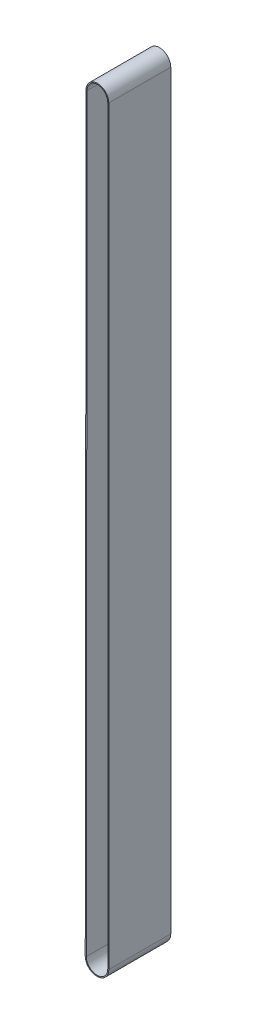
ISO-10303-21;
HEADER;
FILE_DESCRIPTION(('STEP AP214'),'2;1');
FILE_NAME('part.step','',(''),(''),'','','');
FILE_SCHEMA(('AUTOMOTIVE_DESIGN { 1 0 10303 214 1 1 1 1 }'));
ENDSEC;
DATA;
#1=APPLICATION_CONTEXT('core data for automotive mechanical design processes');
#2=APPLICATION_PROTOCOL_DEFINITION('international standard','automotive_design',2000,#1);
#3=PRODUCT_CONTEXT('',#1,'mechanical');
#4=PRODUCT('Part','Part','',(#3));
#5=PRODUCT_RELATED_PRODUCT_CATEGORY('part','',(#4));
#6=PRODUCT_DEFINITION_FORMATION('','',#4);
#7=PRODUCT_DEFINITION_CONTEXT('part definition',#1,'design');
#8=PRODUCT_DEFINITION('design','',#6,#7);
#9=PRODUCT_DEFINITION_SHAPE('','',#8);
#10=(LENGTH_UNIT() NAMED_UNIT(*) SI_UNIT(.MILLI.,.METRE.));
#11=(NAMED_UNIT(*) PLANE_ANGLE_UNIT() SI_UNIT($,.RADIAN.));
#12=(NAMED_UNIT(*) SI_UNIT($,.STERADIAN.) SOLID_ANGLE_UNIT());
#13=UNCERTAINTY_MEASURE_WITH_UNIT(LENGTH_MEASURE(1.E-05),#10,'distance_accuracy_value','');
#14=(GEOMETRIC_REPRESENTATION_CONTEXT(3) GLOBAL_UNCERTAINTY_ASSIGNED_CONTEXT((#13)) GLOBAL_UNIT_ASSIGNED_CONTEXT((#10,
#11,#12)) REPRESENTATION_CONTEXT('',''));
#15=CARTESIAN_POINT('',(0.,0.,0.));
#16=DIRECTION('',(0.,0.,1.));
#17=DIRECTION('',(1.,0.,0.));
#18=AXIS2_PLACEMENT_3D('',#15,#16,#17);
#19=CARTESIAN_POINT('',(-4.46149193977785E-13,-3670.00000000001,300.));
#20=DIRECTION('',(0.,0.,1.));
#21=DIRECTION('',(1.,0.,0.));
#22=AXIS2_PLACEMENT_3D('',#19,#20,#21);
#23=PLANE('',#22);
#24=CARTESIAN_POINT('',(-4.46149193977785E-13,-3670.00000000001,300.));
#25=DIRECTION('',(0.,0.,1.));
#26=DIRECTION('',(1.,0.,0.));
#27=AXIS2_PLACEMENT_3D('',#24,#25,#26);
#28=CIRCLE('',#27,113.999999999998);
#29=CARTESIAN_POINT('',(-113.999930882177,-3669.87446570747,300.));
#30=VERTEX_POINT('',#29);
#31=CARTESIAN_POINT('',(113.999999999998,-3670.00000000001,300.));
#32=VERTEX_POINT('',#31);
#33=EDGE_CURVE('E176',#30,#32,#28,.T.);
#34=ORIENTED_EDGE('',*,*,#33,.T.);
#35=DIRECTION('',(0.,1.,0.));
#36=VECTOR('',#35,1.);
#37=CARTESIAN_POINT('',(113.999999999998,-3670.00000000001,300.));
#38=LINE('',#37,#36);
#39=CARTESIAN_POINT('',(113.999999999998,3595.,300.));
#40=VERTEX_POINT('',#39);
#41=EDGE_CURVE('E180',#32,#40,#38,.T.);
#42=ORIENTED_EDGE('',*,*,#41,.T.);
#43=CARTESIAN_POINT('',(3.99999999999823,3595.,300.));
#44=DIRECTION('',(0.,0.,1.));
#45=DIRECTION('',(1.,0.,0.));
#46=AXIS2_PLACEMENT_3D('',#43,#44,#45);
#47=CIRCLE('',#46,110.);
#48=CARTESIAN_POINT('',(-105.999999855563,3595.00563705871,300.));
#49=VERTEX_POINT('',#48);
#50=EDGE_CURVE('E184',#40,#49,#47,.T.);
#51=ORIENTED_EDGE('',*,*,#50,.T.);
#52=DIRECTION('',(-0.00110117800474589,-0.999999393703317,0.));
#53=VECTOR('',#52,1.);
#54=CARTESIAN_POINT('',(-105.999993937035,3595.01101178005,300.));
#55=LINE('',#54,#53);
#56=EDGE_CURVE('E187',#49,#30,#55,.T.);
#57=ORIENTED_EDGE('',*,*,#56,.T.);
#58=EDGE_LOOP('',(#34,#42,#51,#57));
#59=FACE_BOUND('',#58,.T.);
#60=DIRECTION('',(0.,1.,0.));
#61=VECTOR('',#60,1.);
#62=CARTESIAN_POINT('',(103.999999999998,-3670.00000000001,300.));
#63=LINE('',#62,#61);
#64=CARTESIAN_POINT('',(103.999999999998,-3670.00000000001,300.));
#65=VERTEX_POINT('',#64);
#66=CARTESIAN_POINT('',(103.999999999998,3595.,300.));
#67=VERTEX_POINT('',#66);
#68=EDGE_CURVE('E136',#65,#67,#63,.T.);
#69=ORIENTED_EDGE('',*,*,#68,.F.);
#70=CARTESIAN_POINT('',(-4.46149193977785E-13,-3670.00000000001,300.));
#71=DIRECTION('',(0.,0.,1.));
#72=DIRECTION('',(1.,0.,0.));
#73=AXIS2_PLACEMENT_3D('',#70,#71,#72);
#74=CIRCLE('',#73,103.999999999998);
#75=CARTESIAN_POINT('',(-103.999936945144,-3669.88547748752,300.));
#76=VERTEX_POINT('',#75);
#77=EDGE_CURVE('E127',#76,#65,#74,.T.);
#78=ORIENTED_EDGE('',*,*,#77,.F.);
#79=DIRECTION('',(-0.00110117800474589,-0.999999393703317,0.));
#80=VECTOR('',#79,1.);
#81=CARTESIAN_POINT('',(-96.0000000000016,3595.,300.));
#82=LINE('',#81,#80);
#83=CARTESIAN_POINT('',(-96.0000000000016,3595.,300.));
#84=VERTEX_POINT('',#83);
#85=EDGE_CURVE('E155',#84,#76,#82,.T.);
#86=ORIENTED_EDGE('',*,*,#85,.F.);
#87=CARTESIAN_POINT('',(3.99999999999823,3595.,300.));
#88=DIRECTION('',(0.,0.,1.));
#89=DIRECTION('',(1.,0.,0.));
#90=AXIS2_PLACEMENT_3D('',#87,#88,#89);
#91=CIRCLE('',#90,99.9999999999998);
#92=EDGE_CURVE('E149',#67,#84,#91,.T.);
#93=ORIENTED_EDGE('',*,*,#92,.F.);
#94=EDGE_LOOP('',(#69,#78,#86,#93));
#95=FACE_BOUND('',#94,.T.);
#96=ADVANCED_FACE('F61',(#59,#95),#23,.T.);
#97=CARTESIAN_POINT('',(-4.46149193977785E-13,-3670.00000000001,-300.));
#98=DIRECTION('',(0.,0.,1.));
#99=DIRECTION('',(1.,0.,0.));
#100=AXIS2_PLACEMENT_3D('',#97,#98,#99);
#101=PLANE('',#100);
#102=CARTESIAN_POINT('',(-4.46149193977785E-13,-3670.00000000001,-300.));
#103=DIRECTION('',(0.,0.,1.));
#104=DIRECTION('',(1.,0.,0.));
#105=AXIS2_PLACEMENT_3D('',#102,#103,#104);
#106=CIRCLE('',#105,113.999999999998);
#107=CARTESIAN_POINT('',(-113.999930882177,-3669.87446570747,-300.));
#108=VERTEX_POINT('',#107);
#109=CARTESIAN_POINT('',(113.999999999998,-3670.00000000001,-300.));
#110=VERTEX_POINT('',#109);
#111=EDGE_CURVE('E145',#108,#110,#106,.T.);
#112=ORIENTED_EDGE('',*,*,#111,.F.);
#113=DIRECTION('',(-0.00110117800474589,-0.999999393703317,0.));
#114=VECTOR('',#113,1.);
#115=CARTESIAN_POINT('',(-105.999993937035,3595.01101178005,-300.));
#116=LINE('',#115,#114);
#117=CARTESIAN_POINT('',(-105.999999855563,3595.00563705871,-300.));
#118=VERTEX_POINT('',#117);
#119=EDGE_CURVE('E181',#118,#108,#116,.T.);
#120=ORIENTED_EDGE('',*,*,#119,.F.);
#121=CARTESIAN_POINT('',(3.99999999999823,3595.,-300.));
#122=DIRECTION('',(0.,0.,1.));
#123=DIRECTION('',(1.,0.,0.));
#124=AXIS2_PLACEMENT_3D('',#121,#122,#123);
#125=CIRCLE('',#124,110.);
#126=CARTESIAN_POINT('',(113.999999999998,3595.,-300.));
#127=VERTEX_POINT('',#126);
#128=EDGE_CURVE('E197',#127,#118,#125,.T.);
#129=ORIENTED_EDGE('',*,*,#128,.F.);
#130=DIRECTION('',(0.,1.,0.));
#131=VECTOR('',#130,1.);
#132=CARTESIAN_POINT('',(113.999999999998,-3670.00000000001,-300.));
#133=LINE('',#132,#131);
#134=EDGE_CURVE('E194',#110,#127,#133,.T.);
#135=ORIENTED_EDGE('',*,*,#134,.F.);
#136=EDGE_LOOP('',(#112,#120,#129,#135));
#137=FACE_BOUND('',#136,.T.);
#138=CARTESIAN_POINT('',(-4.46149193977785E-13,-3670.00000000001,-300.));
#139=DIRECTION('',(0.,0.,1.));
#140=DIRECTION('',(1.,0.,0.));
#141=AXIS2_PLACEMENT_3D('',#138,#139,#140);
#142=CIRCLE('',#141,103.999999999998);
#143=CARTESIAN_POINT('',(-103.999936945144,-3669.88547748752,-300.));
#144=VERTEX_POINT('',#143);
#145=CARTESIAN_POINT('',(103.999999999998,-3670.00000000001,-300.));
#146=VERTEX_POINT('',#145);
#147=EDGE_CURVE('E85',#144,#146,#142,.T.);
#148=ORIENTED_EDGE('',*,*,#147,.T.);
#149=DIRECTION('',(0.,1.,0.));
#150=VECTOR('',#149,1.);
#151=CARTESIAN_POINT('',(103.999999999998,-3670.00000000001,-300.));
#152=LINE('',#151,#150);
#153=CARTESIAN_POINT('',(103.999999999998,3595.,-300.));
#154=VERTEX_POINT('',#153);
#155=EDGE_CURVE('E143',#146,#154,#152,.T.);
#156=ORIENTED_EDGE('',*,*,#155,.T.);
#157=CARTESIAN_POINT('',(3.99999999999823,3595.,-300.));
#158=DIRECTION('',(0.,0.,1.));
#159=DIRECTION('',(1.,0.,0.));
#160=AXIS2_PLACEMENT_3D('',#157,#158,#159);
#161=CIRCLE('',#160,99.9999999999998);
#162=CARTESIAN_POINT('',(-96.0000000000016,3595.,-300.));
#163=VERTEX_POINT('',#162);
#164=EDGE_CURVE('E164',#154,#163,#161,.T.);
#165=ORIENTED_EDGE('',*,*,#164,.T.);
#166=DIRECTION('',(-0.00110117800474589,-0.999999393703317,0.));
#167=VECTOR('',#166,1.);
#168=CARTESIAN_POINT('',(-96.0000000000016,3595.,-300.));
#169=LINE('',#168,#167);
#170=EDGE_CURVE('E137',#163,#144,#169,.T.);
#171=ORIENTED_EDGE('',*,*,#170,.T.);
#172=EDGE_LOOP('',(#148,#156,#165,#171));
#173=FACE_BOUND('',#172,.T.);
#174=ADVANCED_FACE('F219',(#137,#173),#101,.F.);
#175=CARTESIAN_POINT('',(-4.46149193977785E-13,-3670.00000000001,300.));
#176=DIRECTION('',(0.,0.,-1.));
#177=DIRECTION('',(-1.,0.,0.));
#178=AXIS2_PLACEMENT_3D('',#175,#176,#177);
#179=CYLINDRICAL_SURFACE('',#178,113.999999999998);
#180=ORIENTED_EDGE('',*,*,#111,.T.);
#181=DIRECTION('',(0.,0.,-1.));
#182=VECTOR('',#181,1.);
#183=CARTESIAN_POINT('',(113.999999999998,-3670.00000000001,300.));
#184=LINE('',#183,#182);
#185=EDGE_CURVE('E12',#32,#110,#184,.T.);
#186=ORIENTED_EDGE('',*,*,#185,.F.);
#187=ORIENTED_EDGE('',*,*,#33,.F.);
#188=DIRECTION('',(0.,0.,-1.));
#189=VECTOR('',#188,1.);
#190=CARTESIAN_POINT('',(-113.999930882177,-3669.87446570747,300.));
#191=LINE('',#190,#189);
#192=EDGE_CURVE('E190',#30,#108,#191,.T.);
#193=ORIENTED_EDGE('',*,*,#192,.T.);
#194=EDGE_LOOP('',(#180,#186,#187,#193));
#195=FACE_BOUND('',#194,.T.);
#196=ADVANCED_FACE('F63',(#195),#179,.T.);
#197=CARTESIAN_POINT('',(113.999999999998,-3670.00000000001,300.));
#198=DIRECTION('',(-1.,0.,0.));
#199=DIRECTION('',(0.,0.,1.));
#200=AXIS2_PLACEMENT_3D('',#197,#198,#199);
#201=PLANE('',#200);
#202=ORIENTED_EDGE('',*,*,#134,.T.);
#203=DIRECTION('',(0.,0.,-1.));
#204=VECTOR('',#203,1.);
#205=CARTESIAN_POINT('',(113.999999999998,3595.,300.));
#206=LINE('',#205,#204);
#207=EDGE_CURVE('E70',#40,#127,#206,.T.);
#208=ORIENTED_EDGE('',*,*,#207,.F.);
#209=ORIENTED_EDGE('',*,*,#41,.F.);
#210=ORIENTED_EDGE('',*,*,#185,.T.);
#211=EDGE_LOOP('',(#202,#208,#209,#210));
#212=FACE_BOUND('',#211,.T.);
#213=ADVANCED_FACE('F229',(#212),#201,.F.);
#214=CARTESIAN_POINT('',(3.99999999999823,3595.,300.));
#215=DIRECTION('',(0.,0.,-1.));
#216=DIRECTION('',(-1.,0.,0.));
#217=AXIS2_PLACEMENT_3D('',#214,#215,#216);
#218=CYLINDRICAL_SURFACE('',#217,110.);
#219=ORIENTED_EDGE('',*,*,#128,.T.);
#220=DIRECTION('',(0.,0.,-1.));
#221=VECTOR('',#220,1.);
#222=CARTESIAN_POINT('',(-105.999999855563,3595.00563705871,300.));
#223=LINE('',#222,#221);
#224=EDGE_CURVE('E205',#49,#118,#223,.T.);
#225=ORIENTED_EDGE('',*,*,#224,.F.);
#226=ORIENTED_EDGE('',*,*,#50,.F.);
#227=ORIENTED_EDGE('',*,*,#207,.T.);
#228=EDGE_LOOP('',(#219,#225,#226,#227));
#229=FACE_BOUND('',#228,.T.);
#230=ADVANCED_FACE('F213',(#229),#218,.T.);
#231=CARTESIAN_POINT('',(-105.999993937035,3595.01101178005,300.));
#232=DIRECTION('',(0.999999393703317,-0.00110117800474589,0.));
#233=DIRECTION('',(0.00110117800474589,0.999999393703317,0.));
#234=AXIS2_PLACEMENT_3D('',#231,#232,#233);
#235=PLANE('',#234);
#236=ORIENTED_EDGE('',*,*,#119,.T.);
#237=ORIENTED_EDGE('',*,*,#192,.F.);
#238=ORIENTED_EDGE('',*,*,#56,.F.);
#239=ORIENTED_EDGE('',*,*,#224,.T.);
#240=EDGE_LOOP('',(#236,#237,#238,#239));
#241=FACE_BOUND('',#240,.T.);
#242=ADVANCED_FACE('F223',(#241),#235,.F.);
#243=CARTESIAN_POINT('',(-4.46149193977785E-13,-3670.00000000001,300.));
#244=DIRECTION('',(0.,0.,-1.));
#245=DIRECTION('',(-1.,0.,0.));
#246=AXIS2_PLACEMENT_3D('',#243,#244,#245);
#247=CYLINDRICAL_SURFACE('',#246,103.999999999998);
#248=ORIENTED_EDGE('',*,*,#147,.F.);
#249=DIRECTION('',(0.,0.,-1.));
#250=VECTOR('',#249,1.);
#251=CARTESIAN_POINT('',(-103.999936945144,-3669.88547748752,300.));
#252=LINE('',#251,#250);
#253=EDGE_CURVE('E131',#76,#144,#252,.T.);
#254=ORIENTED_EDGE('',*,*,#253,.F.);
#255=ORIENTED_EDGE('',*,*,#77,.T.);
#256=DIRECTION('',(0.,0.,-1.));
#257=VECTOR('',#256,1.);
#258=CARTESIAN_POINT('',(103.999999999998,-3670.00000000001,300.));
#259=LINE('',#258,#257);
#260=EDGE_CURVE('E130',#65,#146,#259,.T.);
#261=ORIENTED_EDGE('',*,*,#260,.T.);
#262=EDGE_LOOP('',(#248,#254,#255,#261));
#263=FACE_BOUND('',#262,.T.);
#264=ADVANCED_FACE('F129',(#263),#247,.F.);
#265=CARTESIAN_POINT('',(103.999999999998,-3670.00000000001,300.));
#266=DIRECTION('',(-1.,0.,0.));
#267=DIRECTION('',(0.,0.,1.));
#268=AXIS2_PLACEMENT_3D('',#265,#266,#267);
#269=PLANE('',#268);
#270=ORIENTED_EDGE('',*,*,#155,.F.);
#271=ORIENTED_EDGE('',*,*,#260,.F.);
#272=ORIENTED_EDGE('',*,*,#68,.T.);
#273=DIRECTION('',(0.,0.,-1.));
#274=VECTOR('',#273,1.);
#275=CARTESIAN_POINT('',(103.999999999998,3595.,300.));
#276=LINE('',#275,#274);
#277=EDGE_CURVE('E146',#67,#154,#276,.T.);
#278=ORIENTED_EDGE('',*,*,#277,.T.);
#279=EDGE_LOOP('',(#270,#271,#272,#278));
#280=FACE_BOUND('',#279,.T.);
#281=ADVANCED_FACE('F140',(#280),#269,.T.);
#282=CARTESIAN_POINT('',(3.99999999999823,3595.,300.));
#283=DIRECTION('',(0.,0.,-1.));
#284=DIRECTION('',(-1.,0.,0.));
#285=AXIS2_PLACEMENT_3D('',#282,#283,#284);
#286=CYLINDRICAL_SURFACE('',#285,99.9999999999998);
#287=ORIENTED_EDGE('',*,*,#164,.F.);
#288=ORIENTED_EDGE('',*,*,#277,.F.);
#289=ORIENTED_EDGE('',*,*,#92,.T.);
#290=DIRECTION('',(0.,0.,-1.));
#291=VECTOR('',#290,1.);
#292=CARTESIAN_POINT('',(-96.0000000000016,3595.,300.));
#293=LINE('',#292,#291);
#294=EDGE_CURVE('E77',#84,#163,#293,.T.);
#295=ORIENTED_EDGE('',*,*,#294,.T.);
#296=EDGE_LOOP('',(#287,#288,#289,#295));
#297=FACE_BOUND('',#296,.T.);
#298=ADVANCED_FACE('F252',(#297),#286,.F.);
#299=CARTESIAN_POINT('',(-96.0000000000016,3595.,300.));
#300=DIRECTION('',(0.999999393703317,-0.00110117800474589,0.));
#301=DIRECTION('',(0.00110117800474589,0.999999393703317,0.));
#302=AXIS2_PLACEMENT_3D('',#299,#300,#301);
#303=PLANE('',#302);
#304=ORIENTED_EDGE('',*,*,#170,.F.);
#305=ORIENTED_EDGE('',*,*,#294,.F.);
#306=ORIENTED_EDGE('',*,*,#85,.T.);
#307=ORIENTED_EDGE('',*,*,#253,.T.);
#308=EDGE_LOOP('',(#304,#305,#306,#307));
#309=FACE_BOUND('',#308,.T.);
#310=ADVANCED_FACE('F256',(#309),#303,.T.);
#311=CLOSED_SHELL('',(#96,#174,#196,#213,#230,#242,#264,#281,#298,#310));
#312=MANIFOLD_SOLID_BREP('B2',#311);
#313=ADVANCED_BREP_SHAPE_REPRESENTATION('',(#18,#312),#14);
#314=SHAPE_DEFINITION_REPRESENTATION(#9,#313);
ENDSEC;
END-ISO-10303-21;
